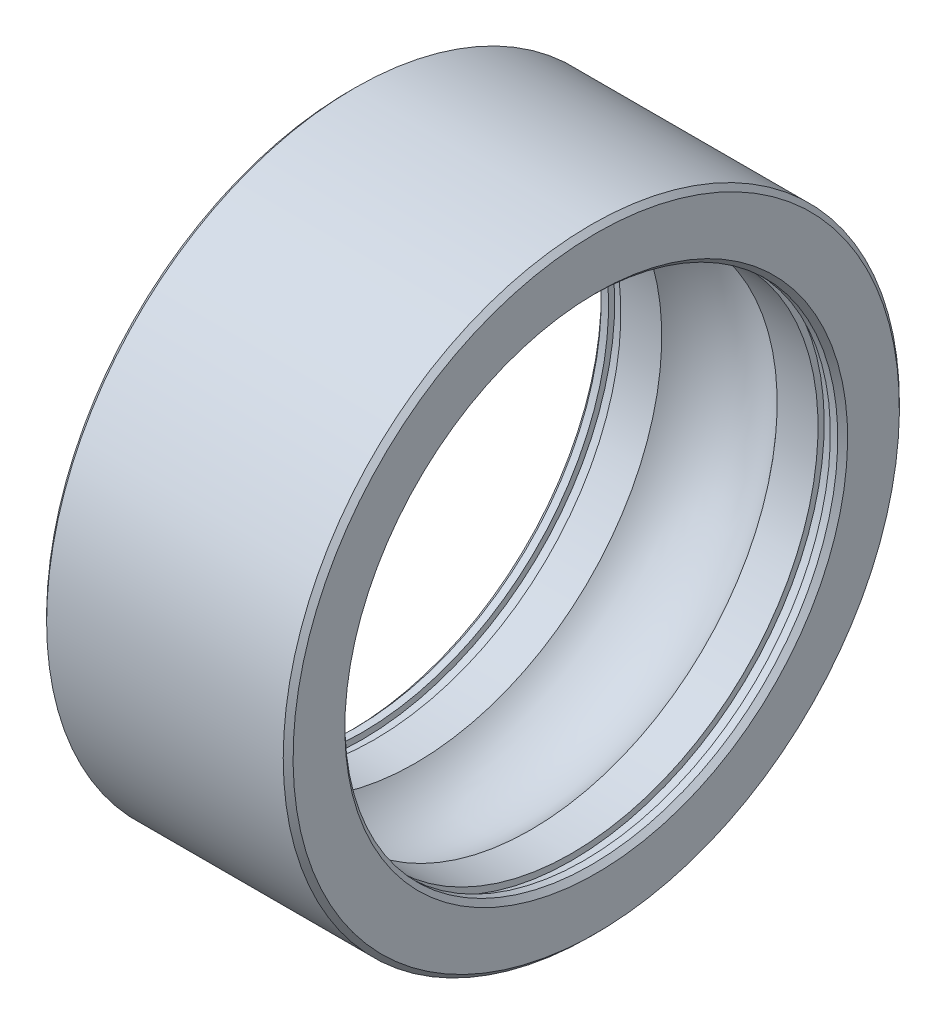
ISO-10303-21;
HEADER;
FILE_DESCRIPTION(('STEP AP214'),'2;1');
FILE_NAME('part.step','',(''),(''),'','','');
FILE_SCHEMA(('AUTOMOTIVE_DESIGN { 1 0 10303 214 1 1 1 1 }'));
ENDSEC;
DATA;
#1=APPLICATION_CONTEXT('core data for automotive mechanical design processes');
#2=APPLICATION_PROTOCOL_DEFINITION('international standard','automotive_design',2000,#1);
#3=PRODUCT_CONTEXT('',#1,'mechanical');
#4=PRODUCT('Part','Part','',(#3));
#5=PRODUCT_RELATED_PRODUCT_CATEGORY('part','',(#4));
#6=PRODUCT_DEFINITION_FORMATION('','',#4);
#7=PRODUCT_DEFINITION_CONTEXT('part definition',#1,'design');
#8=PRODUCT_DEFINITION('design','',#6,#7);
#9=PRODUCT_DEFINITION_SHAPE('','',#8);
#10=(LENGTH_UNIT() NAMED_UNIT(*) SI_UNIT(.MILLI.,.METRE.));
#11=(NAMED_UNIT(*) PLANE_ANGLE_UNIT() SI_UNIT($,.RADIAN.));
#12=(NAMED_UNIT(*) SI_UNIT($,.STERADIAN.) SOLID_ANGLE_UNIT());
#13=UNCERTAINTY_MEASURE_WITH_UNIT(LENGTH_MEASURE(1.E-05),#10,'distance_accuracy_value','');
#14=(GEOMETRIC_REPRESENTATION_CONTEXT(3) GLOBAL_UNCERTAINTY_ASSIGNED_CONTEXT((#13)) GLOBAL_UNIT_ASSIGNED_CONTEXT((#10,
#11,#12)) REPRESENTATION_CONTEXT('',''));
#15=CARTESIAN_POINT('',(0.,0.,0.));
#16=DIRECTION('',(0.,0.,1.));
#17=DIRECTION('',(1.,0.,0.));
#18=AXIS2_PLACEMENT_3D('',#15,#16,#17);
#19=CARTESIAN_POINT('',(1.8,-4.1,0.));
#20=DIRECTION('',(-1.,0.,0.));
#21=DIRECTION('',(0.,-1.,0.));
#22=AXIS2_PLACEMENT_3D('',#19,#20,#21);
#23=PLANE('',#22);
#24=CARTESIAN_POINT('',(1.8,0.,0.));
#25=DIRECTION('',(-1.,0.,0.));
#26=DIRECTION('',(0.,-1.,0.));
#27=AXIS2_PLACEMENT_3D('',#24,#25,#26);
#28=CIRCLE('',#27,4.1);
#29=CARTESIAN_POINT('',(1.8,-4.1,0.));
#30=VERTEX_POINT('',#29);
#31=EDGE_CURVE('E63',#30,#30,#28,.T.);
#32=ORIENTED_EDGE('',*,*,#31,.T.);
#33=EDGE_LOOP('',(#32));
#34=FACE_BOUND('',#33,.T.);
#35=CARTESIAN_POINT('',(1.8,0.,0.));
#36=DIRECTION('',(-1.,0.,0.));
#37=DIRECTION('',(0.,-1.,0.));
#38=AXIS2_PLACEMENT_3D('',#35,#36,#37);
#39=CIRCLE('',#38,4.);
#40=CARTESIAN_POINT('',(1.8,-4.,0.));
#41=VERTEX_POINT('',#40);
#42=EDGE_CURVE('E90',#41,#41,#39,.T.);
#43=ORIENTED_EDGE('',*,*,#42,.F.);
#44=EDGE_LOOP('',(#43));
#45=FACE_BOUND('',#44,.T.);
#46=ADVANCED_FACE('F31',(#34,#45),#23,.T.);
#47=CARTESIAN_POINT('',(-6.42901749222422,0.,0.));
#48=DIRECTION('',(-1.,0.,0.));
#49=DIRECTION('',(0.,-1.,0.));
#50=AXIS2_PLACEMENT_3D('',#47,#48,#49);
#51=CYLINDRICAL_SURFACE('',#50,4.1);
#52=CARTESIAN_POINT('',(1.6,0.,0.));
#53=DIRECTION('',(-1.,0.,0.));
#54=DIRECTION('',(0.,-1.,0.));
#55=AXIS2_PLACEMENT_3D('',#52,#53,#54);
#56=CIRCLE('',#55,4.1);
#57=CARTESIAN_POINT('',(1.6,-4.1,0.));
#58=VERTEX_POINT('',#57);
#59=EDGE_CURVE('E66',#58,#58,#56,.T.);
#60=ORIENTED_EDGE('',*,*,#59,.T.);
#61=EDGE_LOOP('',(#60));
#62=FACE_BOUND('',#61,.T.);
#63=ORIENTED_EDGE('',*,*,#31,.F.);
#64=EDGE_LOOP('',(#63));
#65=FACE_BOUND('',#64,.T.);
#66=ADVANCED_FACE('F97',(#62,#65),#51,.F.);
#67=CARTESIAN_POINT('',(1.6,-4.,0.));
#68=DIRECTION('',(1.,0.,0.));
#69=DIRECTION('',(0.,1.,0.));
#70=AXIS2_PLACEMENT_3D('',#67,#68,#69);
#71=PLANE('',#70);
#72=CARTESIAN_POINT('',(1.6,0.,0.));
#73=DIRECTION('',(-1.,0.,0.));
#74=DIRECTION('',(0.,-1.,0.));
#75=AXIS2_PLACEMENT_3D('',#72,#73,#74);
#76=CIRCLE('',#75,4.);
#77=CARTESIAN_POINT('',(1.6,-4.,0.));
#78=VERTEX_POINT('',#77);
#79=EDGE_CURVE('E69',#78,#78,#76,.T.);
#80=ORIENTED_EDGE('',*,*,#79,.T.);
#81=EDGE_LOOP('',(#80));
#82=FACE_BOUND('',#81,.T.);
#83=ORIENTED_EDGE('',*,*,#59,.F.);
#84=EDGE_LOOP('',(#83));
#85=FACE_BOUND('',#84,.T.);
#86=ADVANCED_FACE('F103',(#82,#85),#71,.T.);
#87=CARTESIAN_POINT('',(-6.42901749222422,0.,0.));
#88=DIRECTION('',(-1.,0.,0.));
#89=DIRECTION('',(0.,-1.,0.));
#90=AXIS2_PLACEMENT_3D('',#87,#88,#89);
#91=CYLINDRICAL_SURFACE('',#90,4.);
#92=CARTESIAN_POINT('',(0.936749699759759,0.,0.));
#93=DIRECTION('',(-1.,0.,0.));
#94=DIRECTION('',(0.,-1.,0.));
#95=AXIS2_PLACEMENT_3D('',#92,#93,#94);
#96=CIRCLE('',#95,4.);
#97=CARTESIAN_POINT('',(0.936749699759759,-4.,0.));
#98=VERTEX_POINT('',#97);
#99=EDGE_CURVE('E72',#98,#98,#96,.T.);
#100=ORIENTED_EDGE('',*,*,#99,.T.);
#101=EDGE_LOOP('',(#100));
#102=FACE_BOUND('',#101,.T.);
#103=ORIENTED_EDGE('',*,*,#79,.F.);
#104=EDGE_LOOP('',(#103));
#105=FACE_BOUND('',#104,.T.);
#106=ADVANCED_FACE('F165',(#102,#105),#91,.F.);
#107=CARTESIAN_POINT('',(0.,0.,0.));
#108=DIRECTION('',(-1.,0.,0.));
#109=DIRECTION('',(0.,-1.,0.));
#110=AXIS2_PLACEMENT_3D('',#107,#108,#109);
#111=TOROIDAL_SURFACE('',#110,3.25,1.2);
#112=CARTESIAN_POINT('',(-0.93674969975976,0.,0.));
#113=DIRECTION('',(-1.,0.,0.));
#114=DIRECTION('',(0.,-1.,0.));
#115=AXIS2_PLACEMENT_3D('',#112,#113,#114);
#116=CIRCLE('',#115,4.);
#117=CARTESIAN_POINT('',(-0.93674969975976,-4.,0.));
#118=VERTEX_POINT('',#117);
#119=EDGE_CURVE('E75',#118,#118,#116,.T.);
#120=ORIENTED_EDGE('',*,*,#119,.T.);
#121=EDGE_LOOP('',(#120));
#122=FACE_BOUND('',#121,.T.);
#123=ORIENTED_EDGE('',*,*,#99,.F.);
#124=EDGE_LOOP('',(#123));
#125=FACE_BOUND('',#124,.T.);
#126=ADVANCED_FACE('F161',(#122,#125),#111,.F.);
#127=CARTESIAN_POINT('',(-6.42901749222422,0.,0.));
#128=DIRECTION('',(-1.,0.,0.));
#129=DIRECTION('',(0.,-1.,0.));
#130=AXIS2_PLACEMENT_3D('',#127,#128,#129);
#131=CYLINDRICAL_SURFACE('',#130,4.);
#132=CARTESIAN_POINT('',(-1.6,0.,0.));
#133=DIRECTION('',(-1.,0.,0.));
#134=DIRECTION('',(0.,-1.,0.));
#135=AXIS2_PLACEMENT_3D('',#132,#133,#134);
#136=CIRCLE('',#135,4.);
#137=CARTESIAN_POINT('',(-1.6,-4.,0.));
#138=VERTEX_POINT('',#137);
#139=EDGE_CURVE('E78',#138,#138,#136,.T.);
#140=ORIENTED_EDGE('',*,*,#139,.T.);
#141=EDGE_LOOP('',(#140));
#142=FACE_BOUND('',#141,.T.);
#143=ORIENTED_EDGE('',*,*,#119,.F.);
#144=EDGE_LOOP('',(#143));
#145=FACE_BOUND('',#144,.T.);
#146=ADVANCED_FACE('F157',(#142,#145),#131,.F.);
#147=CARTESIAN_POINT('',(-1.6,-4.,0.));
#148=DIRECTION('',(-1.,0.,0.));
#149=DIRECTION('',(0.,-1.,0.));
#150=AXIS2_PLACEMENT_3D('',#147,#148,#149);
#151=PLANE('',#150);
#152=CARTESIAN_POINT('',(-1.6,0.,0.));
#153=DIRECTION('',(-1.,0.,0.));
#154=DIRECTION('',(0.,-1.,0.));
#155=AXIS2_PLACEMENT_3D('',#152,#153,#154);
#156=CIRCLE('',#155,4.1);
#157=CARTESIAN_POINT('',(-1.6,-4.1,0.));
#158=VERTEX_POINT('',#157);
#159=EDGE_CURVE('E81',#158,#158,#156,.T.);
#160=ORIENTED_EDGE('',*,*,#159,.T.);
#161=EDGE_LOOP('',(#160));
#162=FACE_BOUND('',#161,.T.);
#163=ORIENTED_EDGE('',*,*,#139,.F.);
#164=EDGE_LOOP('',(#163));
#165=FACE_BOUND('',#164,.T.);
#166=ADVANCED_FACE('F153',(#162,#165),#151,.T.);
#167=CARTESIAN_POINT('',(-6.42901749222422,0.,0.));
#168=DIRECTION('',(-1.,0.,0.));
#169=DIRECTION('',(0.,-1.,0.));
#170=AXIS2_PLACEMENT_3D('',#167,#168,#169);
#171=CYLINDRICAL_SURFACE('',#170,4.1);
#172=CARTESIAN_POINT('',(-1.8,0.,0.));
#173=DIRECTION('',(-1.,0.,0.));
#174=DIRECTION('',(0.,-1.,0.));
#175=AXIS2_PLACEMENT_3D('',#172,#173,#174);
#176=CIRCLE('',#175,4.1);
#177=CARTESIAN_POINT('',(-1.8,-4.1,0.));
#178=VERTEX_POINT('',#177);
#179=EDGE_CURVE('E84',#178,#178,#176,.T.);
#180=ORIENTED_EDGE('',*,*,#179,.T.);
#181=EDGE_LOOP('',(#180));
#182=FACE_BOUND('',#181,.T.);
#183=ORIENTED_EDGE('',*,*,#159,.F.);
#184=EDGE_LOOP('',(#183));
#185=FACE_BOUND('',#184,.T.);
#186=ADVANCED_FACE('F149',(#182,#185),#171,.F.);
#187=CARTESIAN_POINT('',(-1.8,-4.1,0.));
#188=DIRECTION('',(1.,0.,0.));
#189=DIRECTION('',(0.,1.,0.));
#190=AXIS2_PLACEMENT_3D('',#187,#188,#189);
#191=PLANE('',#190);
#192=CARTESIAN_POINT('',(-1.8,0.,0.));
#193=DIRECTION('',(-1.,0.,0.));
#194=DIRECTION('',(0.,-1.,0.));
#195=AXIS2_PLACEMENT_3D('',#192,#193,#194);
#196=CIRCLE('',#195,4.);
#197=CARTESIAN_POINT('',(-1.8,-4.,0.));
#198=VERTEX_POINT('',#197);
#199=EDGE_CURVE('E87',#198,#198,#196,.T.);
#200=ORIENTED_EDGE('',*,*,#199,.T.);
#201=EDGE_LOOP('',(#200));
#202=FACE_BOUND('',#201,.T.);
#203=ORIENTED_EDGE('',*,*,#179,.F.);
#204=EDGE_LOOP('',(#203));
#205=FACE_BOUND('',#204,.T.);
#206=ADVANCED_FACE('F145',(#202,#205),#191,.T.);
#207=CARTESIAN_POINT('',(-6.42901749222422,0.,0.));
#208=DIRECTION('',(-1.,0.,0.));
#209=DIRECTION('',(0.,-1.,0.));
#210=AXIS2_PLACEMENT_3D('',#207,#208,#209);
#211=CYLINDRICAL_SURFACE('',#210,4.);
#212=CARTESIAN_POINT('',(-1.92,0.,0.));
#213=DIRECTION('',(-1.,0.,0.));
#214=DIRECTION('',(0.,-1.,0.));
#215=AXIS2_PLACEMENT_3D('',#212,#213,#214);
#216=CIRCLE('',#215,4.);
#217=CARTESIAN_POINT('',(-1.92,-4.,0.));
#218=VERTEX_POINT('',#217);
#219=EDGE_CURVE('E51',#218,#218,#216,.T.);
#220=ORIENTED_EDGE('',*,*,#219,.T.);
#221=EDGE_LOOP('',(#220));
#222=FACE_BOUND('',#221,.T.);
#223=ORIENTED_EDGE('',*,*,#199,.F.);
#224=EDGE_LOOP('',(#223));
#225=FACE_BOUND('',#224,.T.);
#226=ADVANCED_FACE('F141',(#222,#225),#211,.F.);
#227=CARTESIAN_POINT('',(-2.,-4.,0.));
#228=DIRECTION('',(-1.,0.,0.));
#229=DIRECTION('',(0.,-1.,0.));
#230=AXIS2_PLACEMENT_3D('',#227,#228,#229);
#231=PLANE('',#230);
#232=CARTESIAN_POINT('',(-2.,0.,0.));
#233=DIRECTION('',(-1.,0.,0.));
#234=DIRECTION('',(0.,-1.,0.));
#235=AXIS2_PLACEMENT_3D('',#232,#233,#234);
#236=CIRCLE('',#235,4.08);
#237=CARTESIAN_POINT('',(-2.,-4.08,0.));
#238=VERTEX_POINT('',#237);
#239=EDGE_CURVE('E42',#238,#238,#236,.F.);
#240=ORIENTED_EDGE('',*,*,#239,.T.);
#241=EDGE_LOOP('',(#240));
#242=FACE_BOUND('',#241,.T.);
#243=CARTESIAN_POINT('',(-2.,0.,0.));
#244=DIRECTION('',(-1.,0.,0.));
#245=DIRECTION('',(0.,-1.,0.));
#246=AXIS2_PLACEMENT_3D('',#243,#244,#245);
#247=CIRCLE('',#246,4.91999999999999);
#248=CARTESIAN_POINT('',(-2.,-4.91999999999999,0.));
#249=VERTEX_POINT('',#248);
#250=EDGE_CURVE('E46',#249,#249,#247,.T.);
#251=ORIENTED_EDGE('',*,*,#250,.T.);
#252=EDGE_LOOP('',(#251));
#253=FACE_BOUND('',#252,.T.);
#254=ADVANCED_FACE('F136',(#242,#253),#231,.T.);
#255=CARTESIAN_POINT('',(-6.42901749222422,0.,0.));
#256=DIRECTION('',(-1.,0.,0.));
#257=DIRECTION('',(0.,-1.,0.));
#258=AXIS2_PLACEMENT_3D('',#255,#256,#257);
#259=CYLINDRICAL_SURFACE('',#258,5.);
#260=CARTESIAN_POINT('',(1.92,0.,0.));
#261=DIRECTION('',(1.,0.,0.));
#262=DIRECTION('',(0.,1.,0.));
#263=AXIS2_PLACEMENT_3D('',#260,#261,#262);
#264=CIRCLE('',#263,5.);
#265=CARTESIAN_POINT('',(1.92,5.,0.));
#266=VERTEX_POINT('',#265);
#267=EDGE_CURVE('E10',#266,#266,#264,.F.);
#268=ORIENTED_EDGE('',*,*,#267,.T.);
#269=EDGE_LOOP('',(#268));
#270=FACE_BOUND('',#269,.T.);
#271=CARTESIAN_POINT('',(-1.91999999999999,0.,0.));
#272=DIRECTION('',(-1.,0.,0.));
#273=DIRECTION('',(0.,-1.,0.));
#274=AXIS2_PLACEMENT_3D('',#271,#272,#273);
#275=CIRCLE('',#274,5.);
#276=CARTESIAN_POINT('',(-1.91999999999999,-5.,0.));
#277=VERTEX_POINT('',#276);
#278=EDGE_CURVE('E38',#277,#277,#275,.F.);
#279=ORIENTED_EDGE('',*,*,#278,.T.);
#280=EDGE_LOOP('',(#279));
#281=FACE_BOUND('',#280,.T.);
#282=ADVANCED_FACE('F127',(#270,#281),#259,.T.);
#283=CARTESIAN_POINT('',(2.,-4.,0.));
#284=DIRECTION('',(1.,0.,0.));
#285=DIRECTION('',(0.,1.,0.));
#286=AXIS2_PLACEMENT_3D('',#283,#284,#285);
#287=PLANE('',#286);
#288=CARTESIAN_POINT('',(2.,0.,0.));
#289=DIRECTION('',(1.,0.,0.));
#290=DIRECTION('',(0.,1.,0.));
#291=AXIS2_PLACEMENT_3D('',#288,#289,#290);
#292=CIRCLE('',#291,4.08);
#293=CARTESIAN_POINT('',(2.,4.08,0.));
#294=VERTEX_POINT('',#293);
#295=EDGE_CURVE('E57',#294,#294,#292,.F.);
#296=ORIENTED_EDGE('',*,*,#295,.T.);
#297=EDGE_LOOP('',(#296));
#298=FACE_BOUND('',#297,.T.);
#299=CARTESIAN_POINT('',(2.,0.,0.));
#300=DIRECTION('',(1.,0.,0.));
#301=DIRECTION('',(0.,1.,0.));
#302=AXIS2_PLACEMENT_3D('',#299,#300,#301);
#303=CIRCLE('',#302,4.92);
#304=CARTESIAN_POINT('',(2.,4.92,0.));
#305=VERTEX_POINT('',#304);
#306=EDGE_CURVE('E60',#305,#305,#303,.T.);
#307=ORIENTED_EDGE('',*,*,#306,.T.);
#308=EDGE_LOOP('',(#307));
#309=FACE_BOUND('',#308,.T.);
#310=ADVANCED_FACE('F125',(#298,#309),#287,.T.);
#311=CARTESIAN_POINT('',(-6.42901749222422,0.,0.));
#312=DIRECTION('',(-1.,0.,0.));
#313=DIRECTION('',(0.,-1.,0.));
#314=AXIS2_PLACEMENT_3D('',#311,#312,#313);
#315=CYLINDRICAL_SURFACE('',#314,4.);
#316=CARTESIAN_POINT('',(1.92,0.,0.));
#317=DIRECTION('',(1.,0.,0.));
#318=DIRECTION('',(0.,1.,0.));
#319=AXIS2_PLACEMENT_3D('',#316,#317,#318);
#320=CIRCLE('',#319,4.);
#321=CARTESIAN_POINT('',(1.92,4.,0.));
#322=VERTEX_POINT('',#321);
#323=EDGE_CURVE('E54',#322,#322,#320,.T.);
#324=ORIENTED_EDGE('',*,*,#323,.T.);
#325=EDGE_LOOP('',(#324));
#326=FACE_BOUND('',#325,.T.);
#327=ORIENTED_EDGE('',*,*,#42,.T.);
#328=EDGE_LOOP('',(#327));
#329=FACE_BOUND('',#328,.T.);
#330=ADVANCED_FACE('F94',(#326,#329),#315,.F.);
#331=CARTESIAN_POINT('',(2.,0.,0.));
#332=DIRECTION('',(1.,0.,0.));
#333=DIRECTION('',(0.,1.,0.));
#334=AXIS2_PLACEMENT_3D('',#331,#332,#333);
#335=CONICAL_SURFACE('',#334,4.08,0.785398163397448);
#336=ORIENTED_EDGE('',*,*,#323,.F.);
#337=EDGE_LOOP('',(#336));
#338=FACE_BOUND('',#337,.T.);
#339=ORIENTED_EDGE('',*,*,#295,.F.);
#340=EDGE_LOOP('',(#339));
#341=FACE_BOUND('',#340,.T.);
#342=ADVANCED_FACE('F108',(#338,#341),#335,.F.);
#343=CARTESIAN_POINT('',(-1.92,0.,0.));
#344=DIRECTION('',(-1.,0.,0.));
#345=DIRECTION('',(0.,-1.,0.));
#346=AXIS2_PLACEMENT_3D('',#343,#344,#345);
#347=CONICAL_SURFACE('',#346,4.,0.785398163397459);
#348=ORIENTED_EDGE('',*,*,#239,.F.);
#349=EDGE_LOOP('',(#348));
#350=FACE_BOUND('',#349,.T.);
#351=ORIENTED_EDGE('',*,*,#219,.F.);
#352=EDGE_LOOP('',(#351));
#353=FACE_BOUND('',#352,.T.);
#354=ADVANCED_FACE('F111',(#350,#353),#347,.F.);
#355=CARTESIAN_POINT('',(1.92,0.,0.));
#356=DIRECTION('',(-1.,0.,0.));
#357=DIRECTION('',(0.,-1.,0.));
#358=AXIS2_PLACEMENT_3D('',#355,#356,#357);
#359=CONICAL_SURFACE('',#358,5.,0.785398163397448);
#360=ORIENTED_EDGE('',*,*,#306,.F.);
#361=EDGE_LOOP('',(#360));
#362=FACE_BOUND('',#361,.T.);
#363=ORIENTED_EDGE('',*,*,#267,.F.);
#364=EDGE_LOOP('',(#363));
#365=FACE_BOUND('',#364,.T.);
#366=ADVANCED_FACE('F114',(#362,#365),#359,.T.);
#367=CARTESIAN_POINT('',(-2.,0.,0.));
#368=DIRECTION('',(1.,0.,0.));
#369=DIRECTION('',(0.,1.,0.));
#370=AXIS2_PLACEMENT_3D('',#367,#368,#369);
#371=CONICAL_SURFACE('',#370,4.91999999999999,0.785398163397443);
#372=ORIENTED_EDGE('',*,*,#278,.F.);
#373=EDGE_LOOP('',(#372));
#374=FACE_BOUND('',#373,.T.);
#375=ORIENTED_EDGE('',*,*,#250,.F.);
#376=EDGE_LOOP('',(#375));
#377=FACE_BOUND('',#376,.T.);
#378=ADVANCED_FACE('F33',(#374,#377),#371,.T.);
#379=CLOSED_SHELL('',(#46,#66,#86,#106,#126,#146,#166,#186,#206,#226,#254,#282,#310,#330,#342,
#354,#366,#378));
#380=MANIFOLD_SOLID_BREP('B2',#379);
#381=ADVANCED_BREP_SHAPE_REPRESENTATION('',(#18,#380),#14);
#382=SHAPE_DEFINITION_REPRESENTATION(#9,#381);
ENDSEC;
END-ISO-10303-21;
